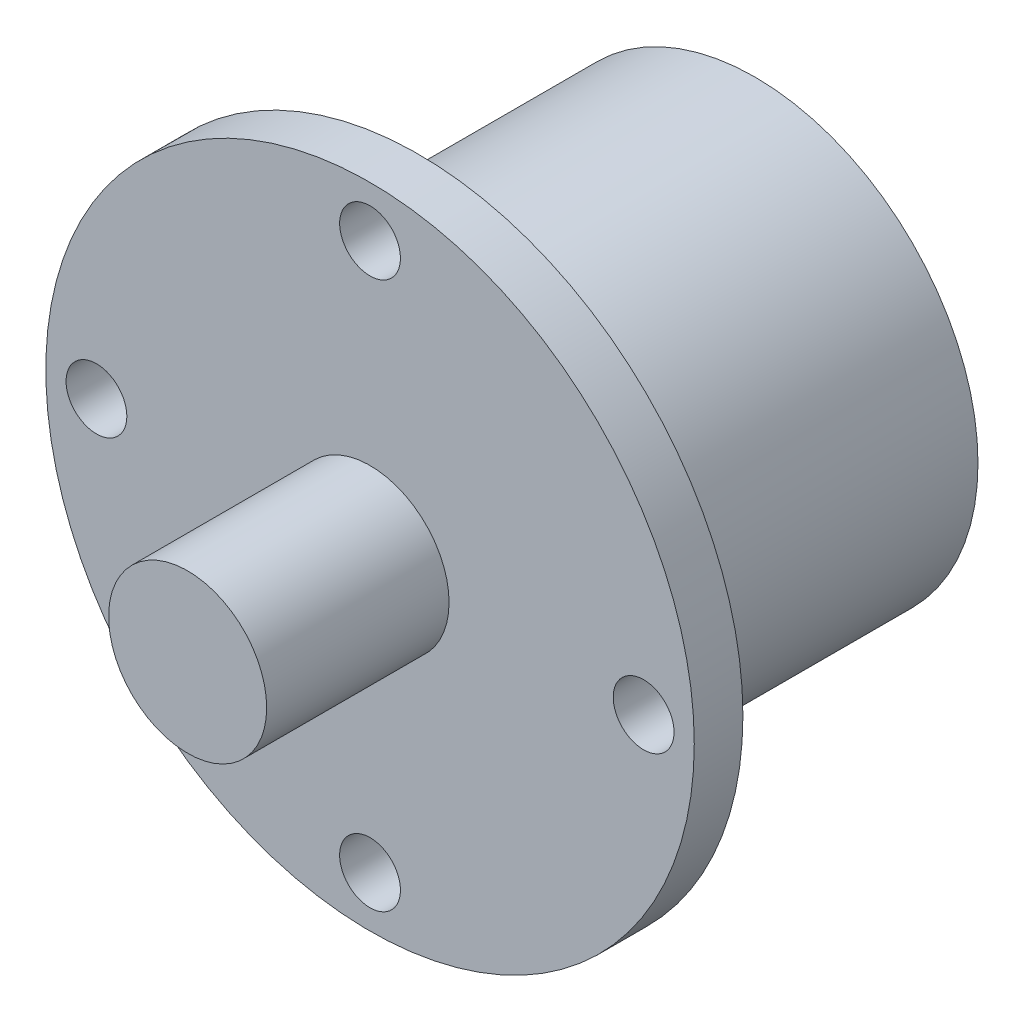
ISO-10303-21;
HEADER;
FILE_DESCRIPTION(('STEP AP214'),'2;1');
FILE_NAME('part.step','',(''),(''),'','','');
FILE_SCHEMA(('AUTOMOTIVE_DESIGN { 1 0 10303 214 1 1 1 1 }'));
ENDSEC;
DATA;
#1=APPLICATION_CONTEXT('core data for automotive mechanical design processes');
#2=APPLICATION_PROTOCOL_DEFINITION('international standard','automotive_design',2000,#1);
#3=PRODUCT_CONTEXT('',#1,'mechanical');
#4=PRODUCT('Part','Part','',(#3));
#5=PRODUCT_RELATED_PRODUCT_CATEGORY('part','',(#4));
#6=PRODUCT_DEFINITION_FORMATION('','',#4);
#7=PRODUCT_DEFINITION_CONTEXT('part definition',#1,'design');
#8=PRODUCT_DEFINITION('design','',#6,#7);
#9=PRODUCT_DEFINITION_SHAPE('','',#8);
#10=(LENGTH_UNIT() NAMED_UNIT(*) SI_UNIT(.MILLI.,.METRE.));
#11=(NAMED_UNIT(*) PLANE_ANGLE_UNIT() SI_UNIT($,.RADIAN.));
#12=(NAMED_UNIT(*) SI_UNIT($,.STERADIAN.) SOLID_ANGLE_UNIT());
#13=UNCERTAINTY_MEASURE_WITH_UNIT(LENGTH_MEASURE(1.E-05),#10,'distance_accuracy_value','');
#14=(GEOMETRIC_REPRESENTATION_CONTEXT(3) GLOBAL_UNCERTAINTY_ASSIGNED_CONTEXT((#13)) GLOBAL_UNIT_ASSIGNED_CONTEXT((#10,
#11,#12)) REPRESENTATION_CONTEXT('',''));
#15=CARTESIAN_POINT('',(0.,0.,0.));
#16=DIRECTION('',(0.,0.,1.));
#17=DIRECTION('',(1.,0.,0.));
#18=AXIS2_PLACEMENT_3D('',#15,#16,#17);
#19=CARTESIAN_POINT('',(0.,0.,2.4));
#20=DIRECTION('',(0.,0.,1.));
#21=DIRECTION('',(1.,0.,0.));
#22=AXIS2_PLACEMENT_3D('',#19,#20,#21);
#23=PLANE('',#22);
#24=CARTESIAN_POINT('',(0.,0.,2.4));
#25=DIRECTION('',(0.,0.,1.));
#26=DIRECTION('',(1.,0.,0.));
#27=AXIS2_PLACEMENT_3D('',#24,#25,#26);
#28=CIRCLE('',#27,3.9);
#29=CARTESIAN_POINT('',(3.9,0.,2.4));
#30=VERTEX_POINT('',#29);
#31=EDGE_CURVE('E74',#30,#30,#28,.T.);
#32=ORIENTED_EDGE('',*,*,#31,.F.);
#33=EDGE_LOOP('',(#32));
#34=FACE_BOUND('',#33,.T.);
#35=CARTESIAN_POINT('',(13.5,0.,2.4));
#36=DIRECTION('',(0.,0.,1.));
#37=DIRECTION('',(1.,0.,0.));
#38=AXIS2_PLACEMENT_3D('',#35,#36,#37);
#39=CIRCLE('',#38,1.5);
#40=CARTESIAN_POINT('',(15.,0.,2.4));
#41=VERTEX_POINT('',#40);
#42=EDGE_CURVE('E59',#41,#41,#39,.T.);
#43=ORIENTED_EDGE('',*,*,#42,.F.);
#44=EDGE_LOOP('',(#43));
#45=FACE_BOUND('',#44,.T.);
#46=CARTESIAN_POINT('',(-13.5,0.,2.4));
#47=DIRECTION('',(0.,0.,1.));
#48=DIRECTION('',(1.,0.,0.));
#49=AXIS2_PLACEMENT_3D('',#46,#47,#48);
#50=CIRCLE('',#49,1.5);
#51=CARTESIAN_POINT('',(-12.,0.,2.4));
#52=VERTEX_POINT('',#51);
#53=EDGE_CURVE('E48',#52,#52,#50,.T.);
#54=ORIENTED_EDGE('',*,*,#53,.F.);
#55=EDGE_LOOP('',(#54));
#56=FACE_BOUND('',#55,.T.);
#57=CARTESIAN_POINT('',(0.,0.,2.4));
#58=DIRECTION('',(0.,0.,1.));
#59=DIRECTION('',(1.,0.,0.));
#60=AXIS2_PLACEMENT_3D('',#57,#58,#59);
#61=CIRCLE('',#60,16.);
#62=CARTESIAN_POINT('',(16.,0.,2.4));
#63=VERTEX_POINT('',#62);
#64=EDGE_CURVE('E39',#63,#63,#61,.T.);
#65=ORIENTED_EDGE('',*,*,#64,.T.);
#66=EDGE_LOOP('',(#65));
#67=FACE_BOUND('',#66,.T.);
#68=CARTESIAN_POINT('',(0.,13.5,2.4));
#69=DIRECTION('',(0.,0.,1.));
#70=DIRECTION('',(1.,0.,0.));
#71=AXIS2_PLACEMENT_3D('',#68,#69,#70);
#72=CIRCLE('',#71,1.5);
#73=CARTESIAN_POINT('',(1.50000000000005,13.5,2.4));
#74=VERTEX_POINT('',#73);
#75=EDGE_CURVE('E53',#74,#74,#72,.T.);
#76=ORIENTED_EDGE('',*,*,#75,.F.);
#77=EDGE_LOOP('',(#76));
#78=FACE_BOUND('',#77,.T.);
#79=CARTESIAN_POINT('',(-1.41404994223147E-13,-13.5,2.4));
#80=DIRECTION('',(0.,0.,1.));
#81=DIRECTION('',(1.,0.,0.));
#82=AXIS2_PLACEMENT_3D('',#79,#80,#81);
#83=CIRCLE('',#82,1.5);
#84=CARTESIAN_POINT('',(1.49999999999986,-13.5,2.4));
#85=VERTEX_POINT('',#84);
#86=EDGE_CURVE('E65',#85,#85,#83,.T.);
#87=ORIENTED_EDGE('',*,*,#86,.F.);
#88=EDGE_LOOP('',(#87));
#89=FACE_BOUND('',#88,.T.);
#90=ADVANCED_FACE('F32',(#34,#45,#56,#67,#78,#89),#23,.T.);
#91=CARTESIAN_POINT('',(0.,0.,0.));
#92=DIRECTION('',(0.,0.,1.));
#93=DIRECTION('',(1.,0.,0.));
#94=AXIS2_PLACEMENT_3D('',#91,#92,#93);
#95=PLANE('',#94);
#96=CARTESIAN_POINT('',(0.,0.,0.));
#97=DIRECTION('',(0.,0.,1.));
#98=DIRECTION('',(1.,0.,0.));
#99=AXIS2_PLACEMENT_3D('',#96,#97,#98);
#100=CIRCLE('',#99,11.);
#101=CARTESIAN_POINT('',(11.,0.,0.));
#102=VERTEX_POINT('',#101);
#103=EDGE_CURVE('E10',#102,#102,#100,.F.);
#104=ORIENTED_EDGE('',*,*,#103,.F.);
#105=EDGE_LOOP('',(#104));
#106=FACE_BOUND('',#105,.T.);
#107=CARTESIAN_POINT('',(0.,0.,0.));
#108=DIRECTION('',(0.,0.,1.));
#109=DIRECTION('',(1.,0.,0.));
#110=AXIS2_PLACEMENT_3D('',#107,#108,#109);
#111=CIRCLE('',#110,16.);
#112=CARTESIAN_POINT('',(16.,0.,0.));
#113=VERTEX_POINT('',#112);
#114=EDGE_CURVE('E43',#113,#113,#111,.T.);
#115=ORIENTED_EDGE('',*,*,#114,.F.);
#116=EDGE_LOOP('',(#115));
#117=FACE_BOUND('',#116,.T.);
#118=CARTESIAN_POINT('',(-13.5,0.,0.));
#119=DIRECTION('',(0.,0.,1.));
#120=DIRECTION('',(1.,0.,0.));
#121=AXIS2_PLACEMENT_3D('',#118,#119,#120);
#122=CIRCLE('',#121,1.5);
#123=CARTESIAN_POINT('',(-12.,0.,0.));
#124=VERTEX_POINT('',#123);
#125=EDGE_CURVE('E50',#124,#124,#122,.T.);
#126=ORIENTED_EDGE('',*,*,#125,.T.);
#127=EDGE_LOOP('',(#126));
#128=FACE_BOUND('',#127,.T.);
#129=CARTESIAN_POINT('',(0.,13.5,0.));
#130=DIRECTION('',(0.,0.,1.));
#131=DIRECTION('',(1.,0.,0.));
#132=AXIS2_PLACEMENT_3D('',#129,#130,#131);
#133=CIRCLE('',#132,1.5);
#134=CARTESIAN_POINT('',(1.50000000000005,13.5,0.));
#135=VERTEX_POINT('',#134);
#136=EDGE_CURVE('E56',#135,#135,#133,.T.);
#137=ORIENTED_EDGE('',*,*,#136,.T.);
#138=EDGE_LOOP('',(#137));
#139=FACE_BOUND('',#138,.T.);
#140=CARTESIAN_POINT('',(13.5,0.,0.));
#141=DIRECTION('',(0.,0.,1.));
#142=DIRECTION('',(1.,0.,0.));
#143=AXIS2_PLACEMENT_3D('',#140,#141,#142);
#144=CIRCLE('',#143,1.5);
#145=CARTESIAN_POINT('',(15.,0.,0.));
#146=VERTEX_POINT('',#145);
#147=EDGE_CURVE('E62',#146,#146,#144,.T.);
#148=ORIENTED_EDGE('',*,*,#147,.T.);
#149=EDGE_LOOP('',(#148));
#150=FACE_BOUND('',#149,.T.);
#151=CARTESIAN_POINT('',(-1.41404994223147E-13,-13.5,0.));
#152=DIRECTION('',(0.,0.,1.));
#153=DIRECTION('',(1.,0.,0.));
#154=AXIS2_PLACEMENT_3D('',#151,#152,#153);
#155=CIRCLE('',#154,1.5);
#156=CARTESIAN_POINT('',(1.49999999999986,-13.5,0.));
#157=VERTEX_POINT('',#156);
#158=EDGE_CURVE('E68',#157,#157,#155,.T.);
#159=ORIENTED_EDGE('',*,*,#158,.T.);
#160=EDGE_LOOP('',(#159));
#161=FACE_BOUND('',#160,.T.);
#162=ADVANCED_FACE('F98',(#106,#117,#128,#139,#150,#161),#95,.F.);
#163=CARTESIAN_POINT('',(0.,0.,2.4));
#164=DIRECTION('',(0.,0.,-1.));
#165=DIRECTION('',(-1.,0.,0.));
#166=AXIS2_PLACEMENT_3D('',#163,#164,#165);
#167=CYLINDRICAL_SURFACE('',#166,16.);
#168=ORIENTED_EDGE('',*,*,#64,.F.);
#169=EDGE_LOOP('',(#168));
#170=FACE_BOUND('',#169,.T.);
#171=ORIENTED_EDGE('',*,*,#114,.T.);
#172=EDGE_LOOP('',(#171));
#173=FACE_BOUND('',#172,.T.);
#174=ADVANCED_FACE('F34',(#170,#173),#167,.T.);
#175=CARTESIAN_POINT('',(-13.5,0.,2.4));
#176=DIRECTION('',(0.,0.,-1.));
#177=DIRECTION('',(-1.,0.,0.));
#178=AXIS2_PLACEMENT_3D('',#175,#176,#177);
#179=CYLINDRICAL_SURFACE('',#178,1.5);
#180=ORIENTED_EDGE('',*,*,#53,.T.);
#181=EDGE_LOOP('',(#180));
#182=FACE_BOUND('',#181,.T.);
#183=ORIENTED_EDGE('',*,*,#125,.F.);
#184=EDGE_LOOP('',(#183));
#185=FACE_BOUND('',#184,.T.);
#186=ADVANCED_FACE('F108',(#182,#185),#179,.F.);
#187=CARTESIAN_POINT('',(0.,13.5,2.4));
#188=DIRECTION('',(0.,0.,-1.));
#189=DIRECTION('',(-1.,0.,0.));
#190=AXIS2_PLACEMENT_3D('',#187,#188,#189);
#191=CYLINDRICAL_SURFACE('',#190,1.5);
#192=ORIENTED_EDGE('',*,*,#75,.T.);
#193=EDGE_LOOP('',(#192));
#194=FACE_BOUND('',#193,.T.);
#195=ORIENTED_EDGE('',*,*,#136,.F.);
#196=EDGE_LOOP('',(#195));
#197=FACE_BOUND('',#196,.T.);
#198=ADVANCED_FACE('F111',(#194,#197),#191,.F.);
#199=CARTESIAN_POINT('',(13.5,0.,2.4));
#200=DIRECTION('',(0.,0.,-1.));
#201=DIRECTION('',(-1.,0.,0.));
#202=AXIS2_PLACEMENT_3D('',#199,#200,#201);
#203=CYLINDRICAL_SURFACE('',#202,1.5);
#204=ORIENTED_EDGE('',*,*,#42,.T.);
#205=EDGE_LOOP('',(#204));
#206=FACE_BOUND('',#205,.T.);
#207=ORIENTED_EDGE('',*,*,#147,.F.);
#208=EDGE_LOOP('',(#207));
#209=FACE_BOUND('',#208,.T.);
#210=ADVANCED_FACE('F115',(#206,#209),#203,.F.);
#211=CARTESIAN_POINT('',(-1.41404994223147E-13,-13.5,2.4));
#212=DIRECTION('',(0.,0.,-1.));
#213=DIRECTION('',(-1.,0.,0.));
#214=AXIS2_PLACEMENT_3D('',#211,#212,#213);
#215=CYLINDRICAL_SURFACE('',#214,1.5);
#216=ORIENTED_EDGE('',*,*,#86,.T.);
#217=EDGE_LOOP('',(#216));
#218=FACE_BOUND('',#217,.T.);
#219=ORIENTED_EDGE('',*,*,#158,.F.);
#220=EDGE_LOOP('',(#219));
#221=FACE_BOUND('',#220,.T.);
#222=ADVANCED_FACE('F119',(#218,#221),#215,.F.);
#223=CARTESIAN_POINT('',(0.,0.,11.4));
#224=DIRECTION('',(0.,0.,-1.));
#225=DIRECTION('',(-1.,0.,0.));
#226=AXIS2_PLACEMENT_3D('',#223,#224,#225);
#227=CYLINDRICAL_SURFACE('',#226,3.9);
#228=CARTESIAN_POINT('',(0.,0.,11.4));
#229=DIRECTION('',(0.,0.,1.));
#230=DIRECTION('',(1.,0.,0.));
#231=AXIS2_PLACEMENT_3D('',#228,#229,#230);
#232=CIRCLE('',#231,3.9);
#233=CARTESIAN_POINT('',(3.9,0.,11.4));
#234=VERTEX_POINT('',#233);
#235=EDGE_CURVE('E71',#234,#234,#232,.T.);
#236=ORIENTED_EDGE('',*,*,#235,.F.);
#237=EDGE_LOOP('',(#236));
#238=FACE_BOUND('',#237,.T.);
#239=ORIENTED_EDGE('',*,*,#31,.T.);
#240=EDGE_LOOP('',(#239));
#241=FACE_BOUND('',#240,.T.);
#242=ADVANCED_FACE('F94',(#238,#241),#227,.T.);
#243=CARTESIAN_POINT('',(0.,0.,11.4));
#244=DIRECTION('',(0.,0.,1.));
#245=DIRECTION('',(1.,0.,0.));
#246=AXIS2_PLACEMENT_3D('',#243,#244,#245);
#247=PLANE('',#246);
#248=ORIENTED_EDGE('',*,*,#235,.T.);
#249=EDGE_LOOP('',(#248));
#250=FACE_BOUND('',#249,.T.);
#251=ADVANCED_FACE('F87',(#250),#247,.T.);
#252=CARTESIAN_POINT('',(0.,0.,-16.6));
#253=DIRECTION('',(0.,0.,1.));
#254=DIRECTION('',(1.,0.,0.));
#255=AXIS2_PLACEMENT_3D('',#252,#253,#254);
#256=CYLINDRICAL_SURFACE('',#255,11.);
#257=CARTESIAN_POINT('',(0.,0.,-16.6));
#258=DIRECTION('',(0.,0.,-1.));
#259=DIRECTION('',(-1.,0.,0.));
#260=AXIS2_PLACEMENT_3D('',#257,#258,#259);
#261=CIRCLE('',#260,11.);
#262=CARTESIAN_POINT('',(-11.,0.,-16.6));
#263=VERTEX_POINT('',#262);
#264=EDGE_CURVE('E77',#263,#263,#261,.T.);
#265=ORIENTED_EDGE('',*,*,#264,.F.);
#266=EDGE_LOOP('',(#265));
#267=FACE_BOUND('',#266,.T.);
#268=ORIENTED_EDGE('',*,*,#103,.T.);
#269=EDGE_LOOP('',(#268));
#270=FACE_BOUND('',#269,.T.);
#271=ADVANCED_FACE('F85',(#267,#270),#256,.T.);
#272=CARTESIAN_POINT('',(0.,0.,-16.6));
#273=DIRECTION('',(0.,0.,-1.));
#274=DIRECTION('',(-1.,0.,0.));
#275=AXIS2_PLACEMENT_3D('',#272,#273,#274);
#276=PLANE('',#275);
#277=ORIENTED_EDGE('',*,*,#264,.T.);
#278=EDGE_LOOP('',(#277));
#279=FACE_BOUND('',#278,.T.);
#280=ADVANCED_FACE('F83',(#279),#276,.T.);
#281=CLOSED_SHELL('',(#90,#162,#174,#186,#198,#210,#222,#242,#251,#271,#280));
#282=MANIFOLD_SOLID_BREP('B2',#281);
#283=ADVANCED_BREP_SHAPE_REPRESENTATION('',(#18,#282),#14);
#284=SHAPE_DEFINITION_REPRESENTATION(#9,#283);
ENDSEC;
END-ISO-10303-21;
